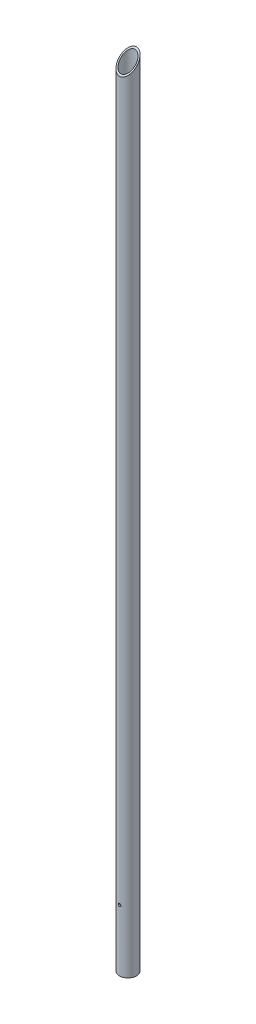
ISO-10303-21;
HEADER;
FILE_DESCRIPTION(('STEP AP214'),'2;1');
FILE_NAME('part.step','',(''),(''),'','','');
FILE_SCHEMA(('AUTOMOTIVE_DESIGN { 1 0 10303 214 1 1 1 1 }'));
ENDSEC;
DATA;
#1=APPLICATION_CONTEXT('core data for automotive mechanical design processes');
#2=APPLICATION_PROTOCOL_DEFINITION('international standard','automotive_design',2000,#1);
#3=PRODUCT_CONTEXT('',#1,'mechanical');
#4=PRODUCT('Part','Part','',(#3));
#5=PRODUCT_RELATED_PRODUCT_CATEGORY('part','',(#4));
#6=PRODUCT_DEFINITION_FORMATION('','',#4);
#7=PRODUCT_DEFINITION_CONTEXT('part definition',#1,'design');
#8=PRODUCT_DEFINITION('design','',#6,#7);
#9=PRODUCT_DEFINITION_SHAPE('','',#8);
#10=(LENGTH_UNIT() NAMED_UNIT(*) SI_UNIT(.MILLI.,.METRE.));
#11=(NAMED_UNIT(*) PLANE_ANGLE_UNIT() SI_UNIT($,.RADIAN.));
#12=(NAMED_UNIT(*) SI_UNIT($,.STERADIAN.) SOLID_ANGLE_UNIT());
#13=UNCERTAINTY_MEASURE_WITH_UNIT(LENGTH_MEASURE(1.E-05),#10,'distance_accuracy_value','');
#14=(GEOMETRIC_REPRESENTATION_CONTEXT(3) GLOBAL_UNCERTAINTY_ASSIGNED_CONTEXT((#13)) GLOBAL_UNIT_ASSIGNED_CONTEXT((#10,
#11,#12)) REPRESENTATION_CONTEXT('',''));
#15=CARTESIAN_POINT('',(0.,0.,0.));
#16=DIRECTION('',(0.,0.,1.));
#17=DIRECTION('',(1.,0.,0.));
#18=AXIS2_PLACEMENT_3D('',#15,#16,#17);
#19=CARTESIAN_POINT('',(0.,152.4,-25.3678512090501));
#20=DIRECTION('',(0.,0.,1.));
#21=DIRECTION('',(1.,0.,0.));
#22=AXIS2_PLACEMENT_3D('',#19,#20,#21);
#23=CYLINDRICAL_SURFACE('',#22,3.302);
#24=CARTESIAN_POINT('',(3.302,152.4,17.212131535635));
#25=CARTESIAN_POINT('',(3.30199130007002,152.216487181355,17.2121357912959));
#26=CARTESIAN_POINT('',(3.28663585313906,152.032743987863,17.2151010141485));
#27=CARTESIAN_POINT('',(3.22562147458273,151.670296185462,17.2266354162427));
#28=CARTESIAN_POINT('',(3.17990188170018,151.491602410788,17.235215812932));
#29=CARTESIAN_POINT('',(3.05960981849084,151.1447641031,17.2569745758185));
#30=CARTESIAN_POINT('',(2.98507722350842,150.976605362395,17.2701465850535));
#31=CARTESIAN_POINT('',(2.80936907233875,150.655239319676,17.2995959096476));
#32=CARTESIAN_POINT('',(2.70820265297165,150.502026914929,17.3158721595603));
#33=CARTESIAN_POINT('',(2.48072155818347,150.21289220966,17.3499290051584));
#34=CARTESIAN_POINT('',(2.35413406488903,150.0771862687,17.3677245991603));
#35=CARTESIAN_POINT('',(2.07998787720686,149.828799162091,17.4026833164607));
#36=CARTESIAN_POINT('',(1.93242669927016,149.716120727047,17.4198463645542));
#37=CARTESIAN_POINT('',(1.6191217258303,149.516175822541,17.4517639888191));
#38=CARTESIAN_POINT('',(1.45324708551855,149.429111002416,17.4664990714186));
#39=CARTESIAN_POINT('',(1.1089023227186,149.284165214522,17.4917344998527));
#40=CARTESIAN_POINT('',(0.930433354973747,149.226281575155,17.5022352333331));
#41=CARTESIAN_POINT('',(0.568185677153339,149.142003116106,17.5177140797912));
#42=CARTESIAN_POINT('',(0.384493776564808,149.115246991672,17.5227555116936));
#43=CARTESIAN_POINT('',(0.0151634313080796,149.092857217496,17.5269660010195));
#44=CARTESIAN_POINT('',(-0.17047484784966,149.097220942566,17.526135553779));
#45=CARTESIAN_POINT('',(-0.535948321762219,149.136670040071,17.5187453165642));
#46=CARTESIAN_POINT('',(-0.715827218444343,149.171366107352,17.5122581315663));
#47=CARTESIAN_POINT('',(-1.06716471944175,149.269879631803,17.4943647240374));
#48=CARTESIAN_POINT('',(-1.23862294887286,149.333698384202,17.4829582827243));
#49=CARTESIAN_POINT('',(-1.56938357210158,149.489018244526,17.4563863678042));
#50=CARTESIAN_POINT('',(-1.72861081598387,149.580675624081,17.4411997634979));
#51=CARTESIAN_POINT('',(-2.02955810161074,149.788948478513,17.4087481619631));
#52=CARTESIAN_POINT('',(-2.17127765430467,149.905564650327,17.3914831067029));
#53=CARTESIAN_POINT('',(-2.43548283118938,150.162566623261,17.35647319222));
#54=CARTESIAN_POINT('',(-2.55764096472364,150.303288832244,17.3387250336484));
#55=CARTESIAN_POINT('',(-2.77672597148959,150.603467611572,17.3049934941075));
#56=CARTESIAN_POINT('',(-2.87364158354752,150.762932497504,17.2890109026162));
#57=CARTESIAN_POINT('',(-3.03957910177399,151.096550975319,17.2606131954961));
#58=CARTESIAN_POINT('',(-3.10853019051617,151.270740525962,17.248207159813));
#59=CARTESIAN_POINT('',(-3.21595739527461,151.628293088118,17.2285032482303));
#60=CARTESIAN_POINT('',(-3.25449780559777,151.811635869916,17.2211945992487));
#61=CARTESIAN_POINT('',(-3.2855165099523,152.06362548086,17.2152867144043));
#62=CARTESIAN_POINT('',(-3.29169262178811,152.130737318688,17.2141062438161));
#63=CARTESIAN_POINT('',(-3.29993596755384,152.265222410831,17.2125278723074));
#64=CARTESIAN_POINT('',(-3.30200319548789,152.332595665527,17.2121299725289));
#65=CARTESIAN_POINT('',(-3.30199130007002,152.583512818645,17.2121357912959));
#66=CARTESIAN_POINT('',(-3.28663585313906,152.767256012137,17.2151010141485));
#67=CARTESIAN_POINT('',(-3.22562147458273,153.129703814538,17.2266354162427));
#68=CARTESIAN_POINT('',(-3.17990188170018,153.308397589212,17.235215812932));
#69=CARTESIAN_POINT('',(-3.05960981849084,153.6552358969,17.2569745758185));
#70=CARTESIAN_POINT('',(-2.98507722350842,153.823394637605,17.2701465850535));
#71=CARTESIAN_POINT('',(-2.80936907233875,154.144760680324,17.2995959096476));
#72=CARTESIAN_POINT('',(-2.70820265297165,154.297973085071,17.3158721595603));
#73=CARTESIAN_POINT('',(-2.48072155818347,154.58710779034,17.3499290051584));
#74=CARTESIAN_POINT('',(-2.35413406488903,154.7228137313,17.3677245991603));
#75=CARTESIAN_POINT('',(-2.07998787720686,154.971200837909,17.4026833164607));
#76=CARTESIAN_POINT('',(-1.93242669927016,155.083879272953,17.4198463645542));
#77=CARTESIAN_POINT('',(-1.6191217258303,155.283824177459,17.4517639888191));
#78=CARTESIAN_POINT('',(-1.45324708551855,155.370888997584,17.4664990714186));
#79=CARTESIAN_POINT('',(-1.1089023227186,155.515834785477,17.4917344998527));
#80=CARTESIAN_POINT('',(-0.930433354973747,155.573718424845,17.5022352333331));
#81=CARTESIAN_POINT('',(-0.568185677153339,155.657996883894,17.5177140797912));
#82=CARTESIAN_POINT('',(-0.384493776564809,155.684753008328,17.5227555116936));
#83=CARTESIAN_POINT('',(-0.0151634313080806,155.707142782504,17.5269660010195));
#84=CARTESIAN_POINT('',(0.17047484784966,155.702779057434,17.526135553779));
#85=CARTESIAN_POINT('',(0.53594832176222,155.663329959929,17.5187453165642));
#86=CARTESIAN_POINT('',(0.715827218444344,155.628633892647,17.5122581315663));
#87=CARTESIAN_POINT('',(1.06716471944175,155.530120368197,17.4943647240374));
#88=CARTESIAN_POINT('',(1.23862294887286,155.466301615798,17.4829582827243));
#89=CARTESIAN_POINT('',(1.56938357210158,155.310981755474,17.4563863678042));
#90=CARTESIAN_POINT('',(1.72861081598386,155.219324375918,17.4411997634979));
#91=CARTESIAN_POINT('',(2.02955810161074,155.011051521487,17.4087481619631));
#92=CARTESIAN_POINT('',(2.17127765430467,154.894435349673,17.3914831067029));
#93=CARTESIAN_POINT('',(2.43548283118938,154.637433376739,17.35647319222));
#94=CARTESIAN_POINT('',(2.55764096472364,154.496711167756,17.3387250336484));
#95=CARTESIAN_POINT('',(2.77672597148959,154.196532388428,17.3049934941075));
#96=CARTESIAN_POINT('',(2.87364158354752,154.037067502496,17.2890109026162));
#97=CARTESIAN_POINT('',(3.03957910177399,153.703449024681,17.2606131954961));
#98=CARTESIAN_POINT('',(3.10853019051617,153.529259474038,17.248207159813));
#99=CARTESIAN_POINT('',(3.21595739527461,153.171706911882,17.2285032482303));
#100=CARTESIAN_POINT('',(3.25449780559777,152.988364130084,17.2211945992488));
#101=CARTESIAN_POINT('',(3.2855165099523,152.73637451914,17.2152867144043));
#102=CARTESIAN_POINT('',(3.29169262178811,152.669262681312,17.2141062438161));
#103=CARTESIAN_POINT('',(3.29993596755384,152.534777589169,17.2125278723074));
#104=CARTESIAN_POINT('',(3.30200319548789,152.467404334473,17.2121299725289));
#105=CARTESIAN_POINT('',(3.302,152.4,17.212131535635));
#106=B_SPLINE_CURVE_WITH_KNOTS('',3,(#24,#25,#26,#27,#28,#29,#30,#31,#32,#33,#34,#35,#36,#37,
#38,#39,#40,#41,#42,#43,#44,#45,#46,#47,#48,#49,#50,#51,#52,#53,#54,#55,#56,#57,#58,#59,#60,#61,
#62,#63,#64,#65,#66,#67,#68,#69,#70,#71,#72,#73,#74,#75,#76,#77,#78,#79,#80,#81,#82,#83,#84,#85,
#86,#87,#88,#89,#90,#91,#92,#93,#94,#95,#96,#97,#98,#99,#100,#101,#102,#103,#104,#105),
.UNSPECIFIED.,.T.,.F.,(4,2,2,2,2,2,2,2,2,2,2,2,2,2,2,2,2,2,2,2,2,2,2,2,2,2,2,2,2,2,2,2,2,2,2,2,
2,2,2,2,4),(0.,0.550280728118762,1.10166412313469,1.65228715504277,2.20272153951084,
2.75941341573731,3.3161712663099,3.87720172279343,4.43818080642108,4.99258136898153,
5.54693516434738,6.09427677939708,6.64164273979222,7.1921399706677,7.74265257536886,
8.30158887354543,8.8607740984918,9.42136669374739,9.98077088361993,10.1828889285657,
10.3850072684503,10.9352879965691,11.486671391585,12.0372944234931,12.5877288079612,
13.1444206841876,13.7011785347602,14.2622089912437,14.8231880748714,15.3775886374318,
15.9319424327977,16.4792840478474,17.0266500082425,17.577147239118,18.1276598438192,
18.6865961419957,19.2457813669421,19.8063739621977,20.3657781520702,20.5678961970161,
20.7700145369006),.UNSPECIFIED.);
#107=CARTESIAN_POINT('',(3.302,152.4,17.212131535635));
#108=VERTEX_POINT('',#107);
#109=EDGE_CURVE('E18',#108,#108,#106,.T.);
#110=ORIENTED_EDGE('',*,*,#109,.T.);
#111=EDGE_LOOP('',(#110));
#112=FACE_BOUND('',#111,.T.);
#113=CARTESIAN_POINT('',(-3.302,152.4,20.8218039564299));
#114=CARTESIAN_POINT('',(-3.30199160753357,152.584072988184,20.8218073806267));
#115=CARTESIAN_POINT('',(-3.28654301260894,152.768382628044,20.8242733684239));
#116=CARTESIAN_POINT('',(-3.22514065789151,153.131977380936,20.8338695525104));
#117=CARTESIAN_POINT('',(-3.17912451730725,153.311251436191,20.8410092863234));
#118=CARTESIAN_POINT('',(-3.05799853788291,153.659258203666,20.8591249107495));
#119=CARTESIAN_POINT('',(-2.98292396446661,153.828003406593,20.870096149862));
#120=CARTESIAN_POINT('',(-2.80588978432559,154.150431959542,20.8946321673488));
#121=CARTESIAN_POINT('',(-2.70394046165791,154.304121040242,20.9081959530987));
#122=CARTESIAN_POINT('',(-2.475080703451,154.593507275824,20.9365245741082));
#123=CARTESIAN_POINT('',(-2.34797939326256,154.729052663828,20.9512980530242));
#124=CARTESIAN_POINT('',(-2.07283012487505,154.976990467367,20.9803050551998));
#125=CARTESIAN_POINT('',(-1.92477991142584,155.089380386901,20.9945385201148));
#126=CARTESIAN_POINT('',(-1.61097959170432,155.28836303058,21.0209503025573));
#127=CARTESIAN_POINT('',(-1.44514095474081,155.374817744744,21.0331174809926));
#128=CARTESIAN_POINT('',(-1.10107506605377,155.518588525655,21.05393135813));
#129=CARTESIAN_POINT('',(-0.922848635277772,155.575906521223,21.0625782898611));
#130=CARTESIAN_POINT('',(-0.560609603386714,155.659322299853,21.0753173636847));
#131=CARTESIAN_POINT('',(-0.376656148144376,155.685671244119,21.0794461292818));
#132=CARTESIAN_POINT('',(-0.00689553053007913,155.707181257663,21.0828093145542));
#133=CARTESIAN_POINT('',(0.1789115224245,155.702344157093,21.0820440214374));
#134=CARTESIAN_POINT('',(0.545387987681611,155.661816777521,21.07573448412));
#135=CARTESIAN_POINT('',(0.72608813932299,155.626397012016,21.0702321418829));
#136=CARTESIAN_POINT('',(1.07894959112664,155.526134356807,21.0551133735714));
#137=CARTESIAN_POINT('',(1.25111058419739,155.461290409778,21.0454967996575));
#138=CARTESIAN_POINT('',(1.58282366581657,155.303743811166,21.0231579611584));
#139=CARTESIAN_POINT('',(1.74232079287566,155.210927306189,21.0104230448454));
#140=CARTESIAN_POINT('',(2.04356567709639,155.000161275276,20.983266477008));
#141=CARTESIAN_POINT('',(2.18531354855576,154.882211911198,20.9688448363465));
#142=CARTESIAN_POINT('',(2.44862169860153,154.62304726144,20.9397407137842));
#143=CARTESIAN_POINT('',(2.56995357233258,154.481599963165,20.925057084518));
#144=CARTESIAN_POINT('',(2.78725086621636,154.180158263545,20.8972247356282));
#145=CARTESIAN_POINT('',(2.88320482169768,154.020155526427,20.8840767112186));
#146=CARTESIAN_POINT('',(3.04705056434818,153.685853288337,20.8608028211873));
#147=CARTESIAN_POINT('',(3.11489418988141,153.51152985874,20.8506821505325));
#148=CARTESIAN_POINT('',(3.22013679209877,153.153999254265,20.8346903229562));
#149=CARTESIAN_POINT('',(3.25760012468805,152.970811734117,20.828810186069));
#150=CARTESIAN_POINT('',(3.28690487349376,152.721930051441,20.8241928990953));
#151=CARTESIAN_POINT('',(3.29256105712587,152.657685718285,20.8232989883506));
#152=CARTESIAN_POINT('',(3.30011009230049,152.528970609118,20.8221039168489));
#153=CARTESIAN_POINT('',(3.30200294075023,152.464499832921,20.8218027565791));
#154=CARTESIAN_POINT('',(3.30199160753357,152.215927011816,20.8218073806267));
#155=CARTESIAN_POINT('',(3.28654301260894,152.031617371956,20.8242733684239));
#156=CARTESIAN_POINT('',(3.22514065789151,151.668022619064,20.8338695525104));
#157=CARTESIAN_POINT('',(3.17912451730725,151.488748563809,20.8410092863234));
#158=CARTESIAN_POINT('',(3.05799853788291,151.140741796334,20.8591249107495));
#159=CARTESIAN_POINT('',(2.98292396446661,150.971996593407,20.870096149862));
#160=CARTESIAN_POINT('',(2.80588978432559,150.649568040458,20.8946321673488));
#161=CARTESIAN_POINT('',(2.70394046165791,150.495878959758,20.9081959530987));
#162=CARTESIAN_POINT('',(2.475080703451,150.206492724176,20.9365245741082));
#163=CARTESIAN_POINT('',(2.34797939326256,150.070947336172,20.9512980530242));
#164=CARTESIAN_POINT('',(2.07283012487505,149.823009532633,20.9803050551998));
#165=CARTESIAN_POINT('',(1.92477991142584,149.710619613099,20.9945385201148));
#166=CARTESIAN_POINT('',(1.61097959170432,149.51163696942,21.0209503025573));
#167=CARTESIAN_POINT('',(1.44514095474081,149.425182255255,21.0331174809926));
#168=CARTESIAN_POINT('',(1.10107506605377,149.281411474344,21.05393135813));
#169=CARTESIAN_POINT('',(0.922848635277772,149.224093478777,21.0625782898611));
#170=CARTESIAN_POINT('',(0.560609603386714,149.140677700147,21.0753173636847));
#171=CARTESIAN_POINT('',(0.376656148144376,149.11432875588,21.0794461292818));
#172=CARTESIAN_POINT('',(0.00689553053007908,149.092818742337,21.0828093145542));
#173=CARTESIAN_POINT('',(-0.1789115224245,149.097655842906,21.0820440214374));
#174=CARTESIAN_POINT('',(-0.545387987681611,149.138183222479,21.07573448412));
#175=CARTESIAN_POINT('',(-0.726088139322989,149.173602987984,21.0702321418829));
#176=CARTESIAN_POINT('',(-1.07894959112664,149.273865643193,21.0551133735714));
#177=CARTESIAN_POINT('',(-1.25111058419739,149.338709590222,21.0454967996575));
#178=CARTESIAN_POINT('',(-1.58282366581657,149.496256188834,21.0231579611584));
#179=CARTESIAN_POINT('',(-1.74232079287566,149.589072693811,21.0104230448454));
#180=CARTESIAN_POINT('',(-2.04356567709639,149.799838724724,20.983266477008));
#181=CARTESIAN_POINT('',(-2.18531354855576,149.917788088802,20.9688448363465));
#182=CARTESIAN_POINT('',(-2.44862169860153,150.17695273856,20.9397407137842));
#183=CARTESIAN_POINT('',(-2.56995357233258,150.318400036835,20.925057084518));
#184=CARTESIAN_POINT('',(-2.78725086621636,150.619841736455,20.8972247356282));
#185=CARTESIAN_POINT('',(-2.88320482169768,150.779844473573,20.8840767112186));
#186=CARTESIAN_POINT('',(-3.04705056434818,151.114146711663,20.8608028211873));
#187=CARTESIAN_POINT('',(-3.11489418988141,151.28847014126,20.8506821505325));
#188=CARTESIAN_POINT('',(-3.22013679209877,151.646000745734,20.8346903229562));
#189=CARTESIAN_POINT('',(-3.25760012468805,151.829188265883,20.828810186069));
#190=CARTESIAN_POINT('',(-3.28690487349375,152.078069948559,20.8241928990953));
#191=CARTESIAN_POINT('',(-3.29256105712586,152.142314281715,20.8232989883506));
#192=CARTESIAN_POINT('',(-3.30011009230049,152.271029390881,20.822103916849));
#193=CARTESIAN_POINT('',(-3.30200294075023,152.335500167079,20.8218027565791));
#194=CARTESIAN_POINT('',(-3.302,152.4,20.8218039564299));
#195=B_SPLINE_CURVE_WITH_KNOTS('',3,(#113,#114,#115,#116,#117,#118,#119,#120,#121,#122,#123,
#124,#125,#126,#127,#128,#129,#130,#131,#132,#133,#134,#135,#136,#137,#138,#139,#140,#141,#142,
#143,#144,#145,#146,#147,#148,#149,#150,#151,#152,#153,#154,#155,#156,#157,#158,#159,#160,#161,
#162,#163,#164,#165,#166,#167,#168,#169,#170,#171,#172,#173,#174,#175,#176,#177,#178,#179,#180,
#181,#182,#183,#184,#185,#186,#187,#188,#189,#190,#191,#192,#193,#194),.UNSPECIFIED.,.T.,.F.,(4,
2,2,2,2,2,2,2,2,2,2,2,2,2,2,2,2,2,2,2,2,2,2,2,2,2,2,2,2,2,2,2,2,2,2,2,2,2,2,2,4),(0.,
0.551972786896807,1.10507548841284,1.65750903647681,2.20973149302036,2.76631755972948,
3.32296359125628,3.882521221157,4.44204180408304,4.9969926192352,5.55191086737877,
6.10197039090305,6.65204968175197,7.20439884684055,7.75674445485041,8.314908940498,
8.87332515223375,9.4326941854617,9.99087516451005,10.1842882427925,10.3777014800249,
10.9296742669217,11.4827769684377,12.0352105165017,12.5874329730452,13.1440190397543,
13.7006650712811,14.2602227011819,14.8197432841079,15.3746940992601,15.9296123474036,
16.4796718709279,17.0297511617768,17.5821003268654,18.1344459348753,18.6926104205229,
19.2510266322586,19.8103956654866,20.3685766445349,20.5619897228173,20.7554029600497),.UNSPECIFIED.);
#196=CARTESIAN_POINT('',(-3.302,152.4,20.8218039564299));
#197=VERTEX_POINT('',#196);
#198=EDGE_CURVE('E45',#197,#197,#195,.T.);
#199=ORIENTED_EDGE('',*,*,#198,.F.);
#200=EDGE_LOOP('',(#199));
#201=FACE_BOUND('',#200,.T.);
#202=ADVANCED_FACE('F14',(#112,#201),#23,.F.);
#203=CARTESIAN_POINT('',(0.,0.,0.));
#204=DIRECTION('',(0.,1.,0.));
#205=DIRECTION('',(0.,0.,1.));
#206=AXIS2_PLACEMENT_3D('',#203,#204,#205);
#207=CYLINDRICAL_SURFACE('',#206,17.526);
#208=CARTESIAN_POINT('',(0.,0.,0.));
#209=DIRECTION('',(0.,1.,0.));
#210=DIRECTION('',(0.,0.,1.));
#211=AXIS2_PLACEMENT_3D('',#208,#209,#210);
#212=CIRCLE('',#211,17.526);
#213=CARTESIAN_POINT('',(0.,0.,17.526));
#214=VERTEX_POINT('',#213);
#215=EDGE_CURVE('E51',#214,#214,#212,.F.);
#216=ORIENTED_EDGE('',*,*,#215,.T.);
#217=EDGE_LOOP('',(#216));
#218=FACE_BOUND('',#217,.T.);
#219=CARTESIAN_POINT('',(-3.302,152.4,-17.212131535635));
#220=CARTESIAN_POINT('',(-3.30199130007002,152.583512818645,-17.2121357912959));
#221=CARTESIAN_POINT('',(-3.28663585313906,152.767256012137,-17.2151010141486));
#222=CARTESIAN_POINT('',(-3.22562147458273,153.129703814538,-17.2266354162427));
#223=CARTESIAN_POINT('',(-3.17990188170018,153.308397589212,-17.235215812932));
#224=CARTESIAN_POINT('',(-3.05960981849084,153.6552358969,-17.2569745758185));
#225=CARTESIAN_POINT('',(-2.98507722350843,153.823394637605,-17.2701465850535));
#226=CARTESIAN_POINT('',(-2.80936907233876,154.144760680324,-17.2995959096476));
#227=CARTESIAN_POINT('',(-2.70820265297166,154.297973085071,-17.3158721595603));
#228=CARTESIAN_POINT('',(-2.48072155818347,154.58710779034,-17.3499290051584));
#229=CARTESIAN_POINT('',(-2.35413406488903,154.7228137313,-17.3677245991603));
#230=CARTESIAN_POINT('',(-2.07998787720685,154.971200837909,-17.4026833164607));
#231=CARTESIAN_POINT('',(-1.93242669927015,155.083879272953,-17.4198463645542));
#232=CARTESIAN_POINT('',(-1.6191217258303,155.283824177459,-17.4517639888191));
#233=CARTESIAN_POINT('',(-1.45324708551855,155.370888997584,-17.4664990714186));
#234=CARTESIAN_POINT('',(-1.1089023227186,155.515834785477,-17.4917344998527));
#235=CARTESIAN_POINT('',(-0.930433354973747,155.573718424845,-17.5022352333331));
#236=CARTESIAN_POINT('',(-0.568185677153339,155.657996883894,-17.5177140797912));
#237=CARTESIAN_POINT('',(-0.384493776564808,155.684753008328,-17.5227555116936));
#238=CARTESIAN_POINT('',(-0.0151634313080796,155.707142782504,-17.5269660010195));
#239=CARTESIAN_POINT('',(0.17047484784966,155.702779057434,-17.526135553779));
#240=CARTESIAN_POINT('',(0.535948321762219,155.663329959929,-17.5187453165642));
#241=CARTESIAN_POINT('',(0.715827218444343,155.628633892647,-17.5122581315663));
#242=CARTESIAN_POINT('',(1.06716471944175,155.530120368197,-17.4943647240374));
#243=CARTESIAN_POINT('',(1.23862294887286,155.466301615798,-17.4829582827243));
#244=CARTESIAN_POINT('',(1.56938357210158,155.310981755474,-17.4563863678042));
#245=CARTESIAN_POINT('',(1.72861081598387,155.219324375918,-17.4411997634979));
#246=CARTESIAN_POINT('',(2.02955810161074,155.011051521487,-17.4087481619631));
#247=CARTESIAN_POINT('',(2.17127765430467,154.894435349673,-17.3914831067029));
#248=CARTESIAN_POINT('',(2.43548283118938,154.637433376739,-17.35647319222));
#249=CARTESIAN_POINT('',(2.55764096472364,154.496711167756,-17.3387250336484));
#250=CARTESIAN_POINT('',(2.77672597148959,154.196532388428,-17.3049934941075));
#251=CARTESIAN_POINT('',(2.87364158354752,154.037067502496,-17.2890109026162));
#252=CARTESIAN_POINT('',(3.03957910177399,153.703449024681,-17.2606131954961));
#253=CARTESIAN_POINT('',(3.10853019051617,153.529259474038,-17.248207159813));
#254=CARTESIAN_POINT('',(3.21595739527461,153.171706911882,-17.2285032482303));
#255=CARTESIAN_POINT('',(3.25449780559777,152.988364130084,-17.2211945992487));
#256=CARTESIAN_POINT('',(3.2855165099523,152.73637451914,-17.2152867144043));
#257=CARTESIAN_POINT('',(3.29169262178811,152.669262681312,-17.2141062438161));
#258=CARTESIAN_POINT('',(3.29993596755384,152.534777589169,-17.2125278723074));
#259=CARTESIAN_POINT('',(3.30200319548789,152.467404334473,-17.2121299725289));
#260=CARTESIAN_POINT('',(3.30199130007002,152.216487181355,-17.2121357912959));
#261=CARTESIAN_POINT('',(3.28663585313906,152.032743987863,-17.2151010141485));
#262=CARTESIAN_POINT('',(3.22562147458273,151.670296185462,-17.2266354162427));
#263=CARTESIAN_POINT('',(3.17990188170018,151.491602410788,-17.235215812932));
#264=CARTESIAN_POINT('',(3.05960981849084,151.1447641031,-17.2569745758185));
#265=CARTESIAN_POINT('',(2.98507722350842,150.976605362395,-17.2701465850535));
#266=CARTESIAN_POINT('',(2.80936907233875,150.655239319676,-17.2995959096476));
#267=CARTESIAN_POINT('',(2.70820265297165,150.502026914929,-17.3158721595603));
#268=CARTESIAN_POINT('',(2.48072155818347,150.21289220966,-17.3499290051584));
#269=CARTESIAN_POINT('',(2.35413406488903,150.0771862687,-17.3677245991603));
#270=CARTESIAN_POINT('',(2.07998787720686,149.828799162091,-17.4026833164607));
#271=CARTESIAN_POINT('',(1.93242669927016,149.716120727047,-17.4198463645542));
#272=CARTESIAN_POINT('',(1.6191217258303,149.516175822541,-17.4517639888191));
#273=CARTESIAN_POINT('',(1.45324708551855,149.429111002416,-17.4664990714186));
#274=CARTESIAN_POINT('',(1.1089023227186,149.284165214522,-17.4917344998527));
#275=CARTESIAN_POINT('',(0.930433354973747,149.226281575155,-17.5022352333331));
#276=CARTESIAN_POINT('',(0.568185677153339,149.142003116106,-17.5177140797912));
#277=CARTESIAN_POINT('',(0.384493776564809,149.115246991672,-17.5227555116936));
#278=CARTESIAN_POINT('',(0.0151634313080805,149.092857217496,-17.5269660010195));
#279=CARTESIAN_POINT('',(-0.17047484784966,149.097220942566,-17.526135553779));
#280=CARTESIAN_POINT('',(-0.53594832176222,149.136670040071,-17.5187453165642));
#281=CARTESIAN_POINT('',(-0.715827218444344,149.171366107352,-17.5122581315663));
#282=CARTESIAN_POINT('',(-1.06716471944175,149.269879631803,-17.4943647240374));
#283=CARTESIAN_POINT('',(-1.23862294887286,149.333698384202,-17.4829582827243));
#284=CARTESIAN_POINT('',(-1.56938357210158,149.489018244526,-17.4563863678042));
#285=CARTESIAN_POINT('',(-1.72861081598386,149.580675624081,-17.4411997634979));
#286=CARTESIAN_POINT('',(-2.02955810161074,149.788948478513,-17.4087481619631));
#287=CARTESIAN_POINT('',(-2.17127765430467,149.905564650327,-17.3914831067029));
#288=CARTESIAN_POINT('',(-2.43548283118938,150.162566623261,-17.35647319222));
#289=CARTESIAN_POINT('',(-2.55764096472364,150.303288832244,-17.3387250336484));
#290=CARTESIAN_POINT('',(-2.77672597148959,150.603467611572,-17.3049934941075));
#291=CARTESIAN_POINT('',(-2.87364158354752,150.762932497504,-17.2890109026162));
#292=CARTESIAN_POINT('',(-3.03957910177399,151.096550975319,-17.2606131954961));
#293=CARTESIAN_POINT('',(-3.10853019051617,151.270740525962,-17.248207159813));
#294=CARTESIAN_POINT('',(-3.21595739527461,151.628293088118,-17.2285032482303));
#295=CARTESIAN_POINT('',(-3.25449780559777,151.811635869916,-17.2211945992488));
#296=CARTESIAN_POINT('',(-3.2855165099523,152.06362548086,-17.2152867144043));
#297=CARTESIAN_POINT('',(-3.29169262178811,152.130737318688,-17.2141062438161));
#298=CARTESIAN_POINT('',(-3.29993596755384,152.265222410831,-17.2125278723074));
#299=CARTESIAN_POINT('',(-3.30200319548789,152.332595665527,-17.2121299725289));
#300=CARTESIAN_POINT('',(-3.302,152.4,-17.212131535635));
#301=B_SPLINE_CURVE_WITH_KNOTS('',3,(#219,#220,#221,#222,#223,#224,#225,#226,#227,#228,#229,
#230,#231,#232,#233,#234,#235,#236,#237,#238,#239,#240,#241,#242,#243,#244,#245,#246,#247,#248,
#249,#250,#251,#252,#253,#254,#255,#256,#257,#258,#259,#260,#261,#262,#263,#264,#265,#266,#267,
#268,#269,#270,#271,#272,#273,#274,#275,#276,#277,#278,#279,#280,#281,#282,#283,#284,#285,#286,
#287,#288,#289,#290,#291,#292,#293,#294,#295,#296,#297,#298,#299,#300),.UNSPECIFIED.,.T.,.F.,(4,
2,2,2,2,2,2,2,2,2,2,2,2,2,2,2,2,2,2,2,2,2,2,2,2,2,2,2,2,2,2,2,2,2,2,2,2,2,2,2,4),(0.,
0.550280728118762,1.10166412313469,1.65228715504274,2.20272153951084,2.75941341573731,
3.3161712663099,3.87720172279343,4.43818080642108,4.99258136898153,5.54693516434738,
6.09427677939708,6.64164273979222,7.1921399706677,7.74265257536886,8.30158887354543,
8.8607740984918,9.42136669374739,9.98077088361993,10.1828889285657,10.3850072684503,
10.9352879965691,11.486671391585,12.0372944234931,12.5877288079612,13.1444206841876,
13.7011785347602,14.2622089912437,14.8231880748714,15.3775886374318,15.9319424327977,
16.4792840478474,17.0266500082425,17.577147239118,18.1276598438192,18.6865961419957,
19.2457813669421,19.8063739621977,20.3657781520702,20.5678961970161,20.7700145369006),.UNSPECIFIED.);
#302=CARTESIAN_POINT('',(-3.302,152.4,-17.212131535635));
#303=VERTEX_POINT('',#302);
#304=EDGE_CURVE('E75',#303,#303,#301,.T.);
#305=ORIENTED_EDGE('',*,*,#304,.T.);
#306=EDGE_LOOP('',(#305));
#307=FACE_BOUND('',#306,.T.);
#308=CARTESIAN_POINT('',(0.,1950.593,0.));
#309=DIRECTION('',(0.,-0.707106781186548,-0.707106781186548));
#310=DIRECTION('',(0.,0.707106781186548,-0.707106781186548));
#311=AXIS2_PLACEMENT_3D('',#308,#309,#310);
#312=ELLIPSE('',#311,24.7855068941509,17.526);
#313=CARTESIAN_POINT('',(0.,1968.119,-17.526));
#314=VERTEX_POINT('',#313);
#315=EDGE_CURVE('E50',#314,#314,#312,.F.);
#316=ORIENTED_EDGE('',*,*,#315,.T.);
#317=EDGE_LOOP('',(#316));
#318=FACE_BOUND('',#317,.T.);
#319=ORIENTED_EDGE('',*,*,#109,.F.);
#320=EDGE_LOOP('',(#319));
#321=FACE_BOUND('',#320,.T.);
#322=ADVANCED_FACE('F61',(#218,#307,#318,#321),#207,.F.);
#323=CARTESIAN_POINT('',(0.,0.,0.));
#324=DIRECTION('',(0.,1.,0.));
#325=DIRECTION('',(0.,0.,1.));
#326=AXIS2_PLACEMENT_3D('',#323,#324,#325);
#327=PLANE('',#326);
#328=ORIENTED_EDGE('',*,*,#215,.F.);
#329=EDGE_LOOP('',(#328));
#330=FACE_BOUND('',#329,.T.);
#331=CARTESIAN_POINT('',(0.,0.,0.));
#332=DIRECTION('',(0.,1.,0.));
#333=DIRECTION('',(0.,0.,1.));
#334=AXIS2_PLACEMENT_3D('',#331,#332,#333);
#335=CIRCLE('',#334,21.082);
#336=CARTESIAN_POINT('',(0.,0.,21.082));
#337=VERTEX_POINT('',#336);
#338=EDGE_CURVE('E29',#337,#337,#335,.T.);
#339=ORIENTED_EDGE('',*,*,#338,.F.);
#340=EDGE_LOOP('',(#339));
#341=FACE_BOUND('',#340,.T.);
#342=ADVANCED_FACE('F63',(#330,#341),#327,.F.);
#343=CARTESIAN_POINT('',(19.8763002146327,1929.511,21.082));
#344=DIRECTION('',(0.,-0.707106781186548,-0.707106781186548));
#345=DIRECTION('',(0.,0.707106781186548,-0.707106781186548));
#346=AXIS2_PLACEMENT_3D('',#343,#344,#345);
#347=PLANE('',#346);
#348=ORIENTED_EDGE('',*,*,#315,.F.);
#349=EDGE_LOOP('',(#348));
#350=FACE_BOUND('',#349,.T.);
#351=CARTESIAN_POINT('',(0.,1950.593,0.));
#352=DIRECTION('',(0.,-0.707106781186548,-0.707106781186548));
#353=DIRECTION('',(0.,0.707106781186548,-0.707106781186548));
#354=AXIS2_PLACEMENT_3D('',#351,#352,#353);
#355=ELLIPSE('',#354,29.8144503219496,21.082);
#356=CARTESIAN_POINT('',(0.,1971.675,-21.082));
#357=VERTEX_POINT('',#356);
#358=EDGE_CURVE('E24',#357,#357,#355,.T.);
#359=ORIENTED_EDGE('',*,*,#358,.F.);
#360=EDGE_LOOP('',(#359));
#361=FACE_BOUND('',#360,.T.);
#362=ADVANCED_FACE('F69',(#350,#361),#347,.F.);
#363=CARTESIAN_POINT('',(0.,152.4,-25.3678512090501));
#364=DIRECTION('',(0.,0.,1.));
#365=DIRECTION('',(1.,0.,0.));
#366=AXIS2_PLACEMENT_3D('',#363,#364,#365);
#367=CYLINDRICAL_SURFACE('',#366,3.302);
#368=ORIENTED_EDGE('',*,*,#304,.F.);
#369=EDGE_LOOP('',(#368));
#370=FACE_BOUND('',#369,.T.);
#371=CARTESIAN_POINT('',(-3.302,152.4,-20.8218039564299));
#372=CARTESIAN_POINT('',(-3.30199160753357,152.215927011816,-20.8218073806267));
#373=CARTESIAN_POINT('',(-3.28654301260894,152.031617371956,-20.8242733684239));
#374=CARTESIAN_POINT('',(-3.22514065789151,151.668022619064,-20.8338695525104));
#375=CARTESIAN_POINT('',(-3.17912451730725,151.488748563809,-20.8410092863234));
#376=CARTESIAN_POINT('',(-3.05799853788291,151.140741796334,-20.8591249107495));
#377=CARTESIAN_POINT('',(-2.98292396446661,150.971996593407,-20.870096149862));
#378=CARTESIAN_POINT('',(-2.80588978432559,150.649568040458,-20.8946321673488));
#379=CARTESIAN_POINT('',(-2.70394046165791,150.495878959758,-20.9081959530987));
#380=CARTESIAN_POINT('',(-2.475080703451,150.206492724176,-20.9365245741082));
#381=CARTESIAN_POINT('',(-2.34797939326256,150.070947336172,-20.9512980530242));
#382=CARTESIAN_POINT('',(-2.07283012487505,149.823009532633,-20.9803050551998));
#383=CARTESIAN_POINT('',(-1.92477991142584,149.710619613099,-20.9945385201148));
#384=CARTESIAN_POINT('',(-1.61097959170432,149.51163696942,-21.0209503025573));
#385=CARTESIAN_POINT('',(-1.44514095474081,149.425182255255,-21.0331174809926));
#386=CARTESIAN_POINT('',(-1.10107506605377,149.281411474344,-21.05393135813));
#387=CARTESIAN_POINT('',(-0.922848635277772,149.224093478777,-21.0625782898611));
#388=CARTESIAN_POINT('',(-0.560609603386714,149.140677700147,-21.0753173636847));
#389=CARTESIAN_POINT('',(-0.376656148144376,149.11432875588,-21.0794461292818));
#390=CARTESIAN_POINT('',(-0.00689553053007908,149.092818742337,-21.0828093145542));
#391=CARTESIAN_POINT('',(0.1789115224245,149.097655842906,-21.0820440214374));
#392=CARTESIAN_POINT('',(0.545387987681611,149.138183222479,-21.07573448412));
#393=CARTESIAN_POINT('',(0.72608813932299,149.173602987984,-21.0702321418829));
#394=CARTESIAN_POINT('',(1.07894959112664,149.273865643193,-21.0551133735714));
#395=CARTESIAN_POINT('',(1.2511105841974,149.338709590222,-21.0454967996575));
#396=CARTESIAN_POINT('',(1.58282366581656,149.496256188834,-21.0231579611584));
#397=CARTESIAN_POINT('',(1.74232079287565,149.589072693811,-21.0104230448454));
#398=CARTESIAN_POINT('',(2.04356567709638,149.799838724724,-20.983266477008));
#399=CARTESIAN_POINT('',(2.18531354855576,149.917788088802,-20.9688448363465));
#400=CARTESIAN_POINT('',(2.44862169860153,150.17695273856,-20.9397407137842));
#401=CARTESIAN_POINT('',(2.56995357233258,150.318400036835,-20.925057084518));
#402=CARTESIAN_POINT('',(2.78725086621636,150.619841736455,-20.8972247356282));
#403=CARTESIAN_POINT('',(2.88320482169768,150.779844473573,-20.8840767112186));
#404=CARTESIAN_POINT('',(3.04705056434818,151.114146711663,-20.8608028211873));
#405=CARTESIAN_POINT('',(3.11489418988141,151.28847014126,-20.8506821505325));
#406=CARTESIAN_POINT('',(3.22013679209877,151.646000745734,-20.8346903229562));
#407=CARTESIAN_POINT('',(3.25760012468805,151.829188265883,-20.828810186069));
#408=CARTESIAN_POINT('',(3.28690487349376,152.078069948559,-20.8241928990953));
#409=CARTESIAN_POINT('',(3.29256105712587,152.142314281715,-20.8232989883506));
#410=CARTESIAN_POINT('',(3.30011009230049,152.271029390881,-20.8221039168489));
#411=CARTESIAN_POINT('',(3.30200294075023,152.335500167079,-20.8218027565791));
#412=CARTESIAN_POINT('',(3.30199160753357,152.584072988184,-20.8218073806267));
#413=CARTESIAN_POINT('',(3.28654301260894,152.768382628044,-20.8242733684239));
#414=CARTESIAN_POINT('',(3.22514065789151,153.131977380936,-20.8338695525104));
#415=CARTESIAN_POINT('',(3.17912451730725,153.311251436191,-20.8410092863234));
#416=CARTESIAN_POINT('',(3.05799853788291,153.659258203666,-20.8591249107495));
#417=CARTESIAN_POINT('',(2.98292396446661,153.828003406593,-20.870096149862));
#418=CARTESIAN_POINT('',(2.80588978432559,154.150431959542,-20.8946321673488));
#419=CARTESIAN_POINT('',(2.70394046165791,154.304121040242,-20.9081959530987));
#420=CARTESIAN_POINT('',(2.475080703451,154.593507275824,-20.9365245741082));
#421=CARTESIAN_POINT('',(2.34797939326256,154.729052663828,-20.9512980530242));
#422=CARTESIAN_POINT('',(2.07283012487505,154.976990467367,-20.9803050551998));
#423=CARTESIAN_POINT('',(1.92477991142584,155.089380386901,-20.9945385201148));
#424=CARTESIAN_POINT('',(1.61097959170432,155.28836303058,-21.0209503025573));
#425=CARTESIAN_POINT('',(1.44514095474081,155.374817744744,-21.0331174809926));
#426=CARTESIAN_POINT('',(1.10107506605377,155.518588525655,-21.05393135813));
#427=CARTESIAN_POINT('',(0.922848635277772,155.575906521223,-21.0625782898611));
#428=CARTESIAN_POINT('',(0.560609603386714,155.659322299853,-21.0753173636847));
#429=CARTESIAN_POINT('',(0.376656148144376,155.685671244119,-21.0794461292818));
#430=CARTESIAN_POINT('',(0.00689553053007867,155.707181257663,-21.0828093145542));
#431=CARTESIAN_POINT('',(-0.178911522424501,155.702344157093,-21.0820440214374));
#432=CARTESIAN_POINT('',(-0.545387987681616,155.661816777521,-21.07573448412));
#433=CARTESIAN_POINT('',(-0.726088139322996,155.626397012016,-21.0702321418829));
#434=CARTESIAN_POINT('',(-1.07894959112665,155.526134356806,-21.0551133735714));
#435=CARTESIAN_POINT('',(-1.2511105841974,155.461290409778,-21.0454967996575));
#436=CARTESIAN_POINT('',(-1.58282366581656,155.303743811166,-21.0231579611584));
#437=CARTESIAN_POINT('',(-1.74232079287565,155.210927306189,-21.0104230448454));
#438=CARTESIAN_POINT('',(-2.04356567709638,155.000161275276,-20.983266477008));
#439=CARTESIAN_POINT('',(-2.18531354855576,154.882211911198,-20.9688448363465));
#440=CARTESIAN_POINT('',(-2.44862169860153,154.62304726144,-20.9397407137842));
#441=CARTESIAN_POINT('',(-2.56995357233258,154.481599963165,-20.925057084518));
#442=CARTESIAN_POINT('',(-2.78725086621636,154.180158263545,-20.8972247356282));
#443=CARTESIAN_POINT('',(-2.88320482169768,154.020155526427,-20.8840767112186));
#444=CARTESIAN_POINT('',(-3.04705056434818,153.685853288337,-20.8608028211873));
#445=CARTESIAN_POINT('',(-3.11489418988141,153.51152985874,-20.8506821505325));
#446=CARTESIAN_POINT('',(-3.22013679209877,153.153999254265,-20.8346903229562));
#447=CARTESIAN_POINT('',(-3.25760012468805,152.970811734117,-20.828810186069));
#448=CARTESIAN_POINT('',(-3.28690487349375,152.721930051441,-20.8241928990953));
#449=CARTESIAN_POINT('',(-3.29256105712586,152.657685718285,-20.8232989883506));
#450=CARTESIAN_POINT('',(-3.30011009230049,152.528970609119,-20.822103916849));
#451=CARTESIAN_POINT('',(-3.30200294075023,152.464499832921,-20.8218027565791));
#452=CARTESIAN_POINT('',(-3.302,152.4,-20.8218039564299));
#453=B_SPLINE_CURVE_WITH_KNOTS('',3,(#371,#372,#373,#374,#375,#376,#377,#378,#379,#380,#381,
#382,#383,#384,#385,#386,#387,#388,#389,#390,#391,#392,#393,#394,#395,#396,#397,#398,#399,#400,
#401,#402,#403,#404,#405,#406,#407,#408,#409,#410,#411,#412,#413,#414,#415,#416,#417,#418,#419,
#420,#421,#422,#423,#424,#425,#426,#427,#428,#429,#430,#431,#432,#433,#434,#435,#436,#437,#438,
#439,#440,#441,#442,#443,#444,#445,#446,#447,#448,#449,#450,#451,#452),.UNSPECIFIED.,.T.,.F.,(4,
2,2,2,2,2,2,2,2,2,2,2,2,2,2,2,2,2,2,2,2,2,2,2,2,2,2,2,2,2,2,2,2,2,2,2,2,2,2,2,4),(0.,
0.551972786896807,1.10507548841284,1.65750903647681,2.20973149302036,2.76631755972948,
3.32296359125628,3.882521221157,4.44204180408304,4.9969926192352,5.55191086737877,
6.10197039090305,6.65204968175197,7.20439884684054,7.75674445485041,8.314908940498,
8.87332515223375,9.4326941854617,9.99087516451005,10.1842882427925,10.3777014800249,
10.9296742669217,11.4827769684377,12.0352105165017,12.5874329730452,13.1440190397543,
13.7006650712811,14.2602227011819,14.8197432841079,15.3746940992601,15.9296123474036,
16.4796718709279,17.0297511617768,17.5821003268654,18.1344459348753,18.6926104205229,
19.2510266322586,19.8103956654865,20.3685766445349,20.5619897228173,20.7554029600497),.UNSPECIFIED.);
#454=CARTESIAN_POINT('',(-3.302,152.4,-20.8218039564299));
#455=VERTEX_POINT('',#454);
#456=EDGE_CURVE('E10',#455,#455,#453,.T.);
#457=ORIENTED_EDGE('',*,*,#456,.F.);
#458=EDGE_LOOP('',(#457));
#459=FACE_BOUND('',#458,.T.);
#460=ADVANCED_FACE('F36',(#370,#459),#367,.F.);
#461=CARTESIAN_POINT('',(0.,0.,0.));
#462=DIRECTION('',(0.,1.,0.));
#463=DIRECTION('',(0.,0.,1.));
#464=AXIS2_PLACEMENT_3D('',#461,#462,#463);
#465=CYLINDRICAL_SURFACE('',#464,21.082);
#466=ORIENTED_EDGE('',*,*,#338,.T.);
#467=EDGE_LOOP('',(#466));
#468=FACE_BOUND('',#467,.T.);
#469=ORIENTED_EDGE('',*,*,#456,.T.);
#470=EDGE_LOOP('',(#469));
#471=FACE_BOUND('',#470,.T.);
#472=ORIENTED_EDGE('',*,*,#358,.T.);
#473=EDGE_LOOP('',(#472));
#474=FACE_BOUND('',#473,.T.);
#475=ORIENTED_EDGE('',*,*,#198,.T.);
#476=EDGE_LOOP('',(#475));
#477=FACE_BOUND('',#476,.T.);
#478=ADVANCED_FACE('F39',(#468,#471,#474,#477),#465,.T.);
#479=CLOSED_SHELL('',(#202,#322,#342,#362,#460,#478));
#480=MANIFOLD_SOLID_BREP('B1',#479);
#481=ADVANCED_BREP_SHAPE_REPRESENTATION('',(#18,#480),#14);
#482=SHAPE_DEFINITION_REPRESENTATION(#9,#481);
ENDSEC;
END-ISO-10303-21;
